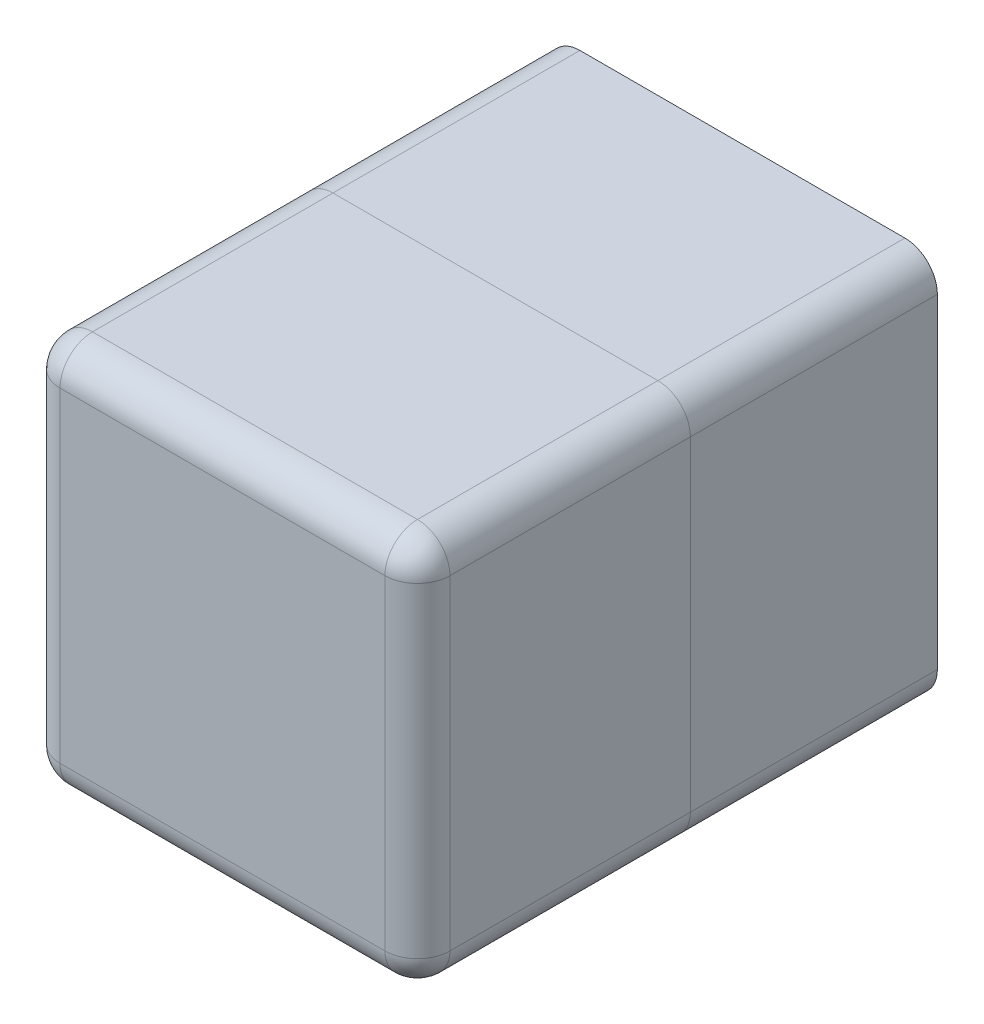
ISO-10303-21;
HEADER;
FILE_DESCRIPTION(('STEP AP214'),'2;1');
FILE_NAME('part.step','',(''),(''),'','','');
FILE_SCHEMA(('AUTOMOTIVE_DESIGN { 1 0 10303 214 1 1 1 1 }'));
ENDSEC;
DATA;
#1=APPLICATION_CONTEXT('core data for automotive mechanical design processes');
#2=APPLICATION_PROTOCOL_DEFINITION('international standard','automotive_design',2000,#1);
#3=PRODUCT_CONTEXT('',#1,'mechanical');
#4=PRODUCT('Part','Part','',(#3));
#5=PRODUCT_RELATED_PRODUCT_CATEGORY('part','',(#4));
#6=PRODUCT_DEFINITION_FORMATION('','',#4);
#7=PRODUCT_DEFINITION_CONTEXT('part definition',#1,'design');
#8=PRODUCT_DEFINITION('design','',#6,#7);
#9=PRODUCT_DEFINITION_SHAPE('','',#8);
#10=(LENGTH_UNIT() NAMED_UNIT(*) SI_UNIT(.MILLI.,.METRE.));
#11=(NAMED_UNIT(*) PLANE_ANGLE_UNIT() SI_UNIT($,.RADIAN.));
#12=(NAMED_UNIT(*) SI_UNIT($,.STERADIAN.) SOLID_ANGLE_UNIT());
#13=UNCERTAINTY_MEASURE_WITH_UNIT(LENGTH_MEASURE(1.E-05),#10,'distance_accuracy_value','');
#14=(GEOMETRIC_REPRESENTATION_CONTEXT(3) GLOBAL_UNCERTAINTY_ASSIGNED_CONTEXT((#13)) GLOBAL_UNIT_ASSIGNED_CONTEXT((#10,
#11,#12)) REPRESENTATION_CONTEXT('',''));
#15=CARTESIAN_POINT('',(0.,0.,0.));
#16=DIRECTION('',(0.,0.,1.));
#17=DIRECTION('',(1.,0.,0.));
#18=AXIS2_PLACEMENT_3D('',#15,#16,#17);
#19=CARTESIAN_POINT('',(60.,0.,-38.));
#20=DIRECTION('',(0.,1.,0.));
#21=DIRECTION('',(0.,0.,1.));
#22=AXIS2_PLACEMENT_3D('',#19,#20,#21);
#23=PLANE('',#22);
#24=DIRECTION('',(-1.,0.,0.));
#25=VECTOR('',#24,1.);
#26=CARTESIAN_POINT('',(60.,0.,0.));
#27=LINE('',#26,#25);
#28=CARTESIAN_POINT('',(55.,0.,0.));
#29=VERTEX_POINT('',#28);
#30=CARTESIAN_POINT('',(5.,0.,0.));
#31=VERTEX_POINT('',#30);
#32=EDGE_CURVE('E145',#29,#31,#27,.T.);
#33=ORIENTED_EDGE('',*,*,#32,.T.);
#34=DIRECTION('',(0.,0.,1.));
#35=VECTOR('',#34,1.);
#36=CARTESIAN_POINT('',(5.,0.,-38.));
#37=LINE('',#36,#35);
#38=CARTESIAN_POINT('',(5.,0.,-38.));
#39=VERTEX_POINT('',#38);
#40=EDGE_CURVE('E123',#31,#39,#37,.F.);
#41=ORIENTED_EDGE('',*,*,#40,.T.);
#42=DIRECTION('',(-1.,0.,0.));
#43=VECTOR('',#42,1.);
#44=CARTESIAN_POINT('',(60.,0.,-38.));
#45=LINE('',#44,#43);
#46=CARTESIAN_POINT('',(55.,0.,-38.));
#47=VERTEX_POINT('',#46);
#48=EDGE_CURVE('E155',#47,#39,#45,.T.);
#49=ORIENTED_EDGE('',*,*,#48,.F.);
#50=DIRECTION('',(0.,0.,1.));
#51=VECTOR('',#50,1.);
#52=CARTESIAN_POINT('',(55.,0.,-38.));
#53=LINE('',#52,#51);
#54=EDGE_CURVE('E128',#47,#29,#53,.T.);
#55=ORIENTED_EDGE('',*,*,#54,.T.);
#56=EDGE_LOOP('',(#33,#41,#49,#55));
#57=FACE_BOUND('',#56,.T.);
#58=ADVANCED_FACE('F52',(#57),#23,.F.);
#59=CARTESIAN_POINT('',(0.,0.,-38.));
#60=DIRECTION('',(1.,0.,0.));
#61=DIRECTION('',(0.,0.,-1.));
#62=AXIS2_PLACEMENT_3D('',#59,#60,#61);
#63=PLANE('',#62);
#64=DIRECTION('',(0.,1.,0.));
#65=VECTOR('',#64,1.);
#66=CARTESIAN_POINT('',(0.,0.,-38.));
#67=LINE('',#66,#65);
#68=CARTESIAN_POINT('',(0.,5.,-38.));
#69=VERTEX_POINT('',#68);
#70=CARTESIAN_POINT('',(0.,55.,-38.));
#71=VERTEX_POINT('',#70);
#72=EDGE_CURVE('E138',#69,#71,#67,.T.);
#73=ORIENTED_EDGE('',*,*,#72,.F.);
#74=DIRECTION('',(0.,0.,1.));
#75=VECTOR('',#74,1.);
#76=CARTESIAN_POINT('',(0.,5.,-38.));
#77=LINE('',#76,#75);
#78=CARTESIAN_POINT('',(0.,5.,0.));
#79=VERTEX_POINT('',#78);
#80=EDGE_CURVE('E122',#69,#79,#77,.T.);
#81=ORIENTED_EDGE('',*,*,#80,.T.);
#82=DIRECTION('',(0.,1.,0.));
#83=VECTOR('',#82,1.);
#84=CARTESIAN_POINT('',(0.,0.,0.));
#85=LINE('',#84,#83);
#86=CARTESIAN_POINT('',(0.,55.,0.));
#87=VERTEX_POINT('',#86);
#88=EDGE_CURVE('E135',#79,#87,#85,.T.);
#89=ORIENTED_EDGE('',*,*,#88,.T.);
#90=DIRECTION('',(0.,0.,1.));
#91=VECTOR('',#90,1.);
#92=CARTESIAN_POINT('',(0.,55.,-38.));
#93=LINE('',#92,#91);
#94=EDGE_CURVE('E140',#87,#71,#93,.F.);
#95=ORIENTED_EDGE('',*,*,#94,.T.);
#96=EDGE_LOOP('',(#73,#81,#89,#95));
#97=FACE_BOUND('',#96,.T.);
#98=ADVANCED_FACE('F134',(#97),#63,.F.);
#99=CARTESIAN_POINT('',(0.,60.,-38.));
#100=DIRECTION('',(0.,-1.,0.));
#101=DIRECTION('',(0.,0.,-1.));
#102=AXIS2_PLACEMENT_3D('',#99,#100,#101);
#103=PLANE('',#102);
#104=DIRECTION('',(1.,0.,0.));
#105=VECTOR('',#104,1.);
#106=CARTESIAN_POINT('',(0.,60.,0.));
#107=LINE('',#106,#105);
#108=CARTESIAN_POINT('',(5.,60.,0.));
#109=VERTEX_POINT('',#108);
#110=CARTESIAN_POINT('',(55.,60.,0.));
#111=VERTEX_POINT('',#110);
#112=EDGE_CURVE('E144',#109,#111,#107,.T.);
#113=ORIENTED_EDGE('',*,*,#112,.T.);
#114=DIRECTION('',(0.,0.,1.));
#115=VECTOR('',#114,1.);
#116=CARTESIAN_POINT('',(55.,60.,-38.));
#117=LINE('',#116,#115);
#118=CARTESIAN_POINT('',(55.,60.,-38.));
#119=VERTEX_POINT('',#118);
#120=EDGE_CURVE('E12',#111,#119,#117,.F.);
#121=ORIENTED_EDGE('',*,*,#120,.T.);
#122=DIRECTION('',(1.,0.,0.));
#123=VECTOR('',#122,1.);
#124=CARTESIAN_POINT('',(0.,60.,-38.));
#125=LINE('',#124,#123);
#126=CARTESIAN_POINT('',(5.,60.,-38.));
#127=VERTEX_POINT('',#126);
#128=EDGE_CURVE('E181',#127,#119,#125,.T.);
#129=ORIENTED_EDGE('',*,*,#128,.F.);
#130=DIRECTION('',(0.,0.,1.));
#131=VECTOR('',#130,1.);
#132=CARTESIAN_POINT('',(5.,60.,-38.));
#133=LINE('',#132,#131);
#134=EDGE_CURVE('E60',#127,#109,#133,.T.);
#135=ORIENTED_EDGE('',*,*,#134,.T.);
#136=EDGE_LOOP('',(#113,#121,#129,#135));
#137=FACE_BOUND('',#136,.T.);
#138=ADVANCED_FACE('F179',(#137),#103,.F.);
#139=CARTESIAN_POINT('',(60.,60.,-38.));
#140=DIRECTION('',(-1.,0.,0.));
#141=DIRECTION('',(0.,0.,1.));
#142=AXIS2_PLACEMENT_3D('',#139,#140,#141);
#143=PLANE('',#142);
#144=DIRECTION('',(0.,-1.,0.));
#145=VECTOR('',#144,1.);
#146=CARTESIAN_POINT('',(60.,60.,0.));
#147=LINE('',#146,#145);
#148=CARTESIAN_POINT('',(60.,55.,0.));
#149=VERTEX_POINT('',#148);
#150=CARTESIAN_POINT('',(60.,5.,0.));
#151=VERTEX_POINT('',#150);
#152=EDGE_CURVE('E148',#149,#151,#147,.T.);
#153=ORIENTED_EDGE('',*,*,#152,.T.);
#154=DIRECTION('',(0.,0.,1.));
#155=VECTOR('',#154,1.);
#156=CARTESIAN_POINT('',(60.,5.,-38.));
#157=LINE('',#156,#155);
#158=CARTESIAN_POINT('',(60.,5.,-38.));
#159=VERTEX_POINT('',#158);
#160=EDGE_CURVE('E67',#151,#159,#157,.F.);
#161=ORIENTED_EDGE('',*,*,#160,.T.);
#162=DIRECTION('',(0.,-1.,0.));
#163=VECTOR('',#162,1.);
#164=CARTESIAN_POINT('',(60.,60.,-38.));
#165=LINE('',#164,#163);
#166=CARTESIAN_POINT('',(60.,55.,-38.));
#167=VERTEX_POINT('',#166);
#168=EDGE_CURVE('E156',#167,#159,#165,.T.);
#169=ORIENTED_EDGE('',*,*,#168,.F.);
#170=DIRECTION('',(0.,0.,1.));
#171=VECTOR('',#170,1.);
#172=CARTESIAN_POINT('',(60.,55.,-38.));
#173=LINE('',#172,#171);
#174=EDGE_CURVE('E172',#167,#149,#173,.T.);
#175=ORIENTED_EDGE('',*,*,#174,.T.);
#176=EDGE_LOOP('',(#153,#161,#169,#175));
#177=FACE_BOUND('',#176,.T.);
#178=ADVANCED_FACE('F188',(#177),#143,.F.);
#179=CARTESIAN_POINT('',(0.,0.,-38.));
#180=DIRECTION('',(0.,0.,-1.));
#181=DIRECTION('',(-1.,0.,0.));
#182=AXIS2_PLACEMENT_3D('',#179,#180,#181);
#183=PLANE('',#182);
#184=CARTESIAN_POINT('',(30.,40.,-38.));
#185=DIRECTION('',(0.,0.,-1.));
#186=DIRECTION('',(-1.,0.,0.));
#187=AXIS2_PLACEMENT_3D('',#184,#185,#186);
#188=CIRCLE('',#187,12.);
#189=CARTESIAN_POINT('',(18.,40.,-38.));
#190=VERTEX_POINT('',#189);
#191=EDGE_CURVE('E219',#190,#190,#188,.T.);
#192=ORIENTED_EDGE('',*,*,#191,.F.);
#193=EDGE_LOOP('',(#192));
#194=FACE_BOUND('',#193,.T.);
#195=CARTESIAN_POINT('',(5.25126265847084,5.25126265847083,-38.));
#196=DIRECTION('',(0.,0.,-1.));
#197=DIRECTION('',(1.,0.,0.));
#198=AXIS2_PLACEMENT_3D('',#195,#196,#197);
#199=CIRCLE('',#198,2.25);
#200=CARTESIAN_POINT('',(7.50126265847084,5.25126265847083,-38.));
#201=VERTEX_POINT('',#200);
#202=EDGE_CURVE('E201',#201,#201,#199,.T.);
#203=ORIENTED_EDGE('',*,*,#202,.F.);
#204=EDGE_LOOP('',(#203));
#205=FACE_BOUND('',#204,.T.);
#206=CARTESIAN_POINT('',(54.7487373415292,5.25126265847084,-38.));
#207=DIRECTION('',(0.,0.,-1.));
#208=DIRECTION('',(-1.,0.,0.));
#209=AXIS2_PLACEMENT_3D('',#206,#207,#208);
#210=CIRCLE('',#209,2.25);
#211=CARTESIAN_POINT('',(52.4987373415292,5.25126265847084,-38.));
#212=VERTEX_POINT('',#211);
#213=EDGE_CURVE('E208',#212,#212,#210,.T.);
#214=ORIENTED_EDGE('',*,*,#213,.F.);
#215=EDGE_LOOP('',(#214));
#216=FACE_BOUND('',#215,.T.);
#217=CARTESIAN_POINT('',(54.7487373415292,54.7487373415292,-38.));
#218=DIRECTION('',(0.,0.,-1.));
#219=DIRECTION('',(1.,0.,0.));
#220=AXIS2_PLACEMENT_3D('',#217,#218,#219);
#221=CIRCLE('',#220,2.25);
#222=CARTESIAN_POINT('',(56.9987373415292,54.7487373415292,-38.));
#223=VERTEX_POINT('',#222);
#224=EDGE_CURVE('E214',#223,#223,#221,.T.);
#225=ORIENTED_EDGE('',*,*,#224,.F.);
#226=EDGE_LOOP('',(#225));
#227=FACE_BOUND('',#226,.T.);
#228=CARTESIAN_POINT('',(5.25126265847084,54.7487373415292,-38.));
#229=DIRECTION('',(0.,0.,-1.));
#230=DIRECTION('',(-1.,0.,0.));
#231=AXIS2_PLACEMENT_3D('',#228,#229,#230);
#232=CIRCLE('',#231,2.25);
#233=CARTESIAN_POINT('',(3.00126265847084,54.7487373415292,-38.));
#234=VERTEX_POINT('',#233);
#235=EDGE_CURVE('E195',#234,#234,#232,.T.);
#236=ORIENTED_EDGE('',*,*,#235,.F.);
#237=EDGE_LOOP('',(#236));
#238=FACE_BOUND('',#237,.T.);
#239=ORIENTED_EDGE('',*,*,#48,.T.);
#240=CARTESIAN_POINT('',(5.,5.,-38.));
#241=DIRECTION('',(0.,0.,-1.));
#242=DIRECTION('',(-1.,0.,0.));
#243=AXIS2_PLACEMENT_3D('',#240,#241,#242);
#244=CIRCLE('',#243,5.);
#245=EDGE_CURVE('E170',#39,#69,#244,.T.);
#246=ORIENTED_EDGE('',*,*,#245,.T.);
#247=ORIENTED_EDGE('',*,*,#72,.T.);
#248=CARTESIAN_POINT('',(5.,55.,-38.));
#249=DIRECTION('',(0.,0.,-1.));
#250=DIRECTION('',(-1.,0.,0.));
#251=AXIS2_PLACEMENT_3D('',#248,#249,#250);
#252=CIRCLE('',#251,5.);
#253=EDGE_CURVE('E165',#71,#127,#252,.T.);
#254=ORIENTED_EDGE('',*,*,#253,.T.);
#255=ORIENTED_EDGE('',*,*,#128,.T.);
#256=CARTESIAN_POINT('',(55.,55.,-38.));
#257=DIRECTION('',(0.,0.,-1.));
#258=DIRECTION('',(-1.,0.,0.));
#259=AXIS2_PLACEMENT_3D('',#256,#257,#258);
#260=CIRCLE('',#259,5.);
#261=EDGE_CURVE('E74',#119,#167,#260,.T.);
#262=ORIENTED_EDGE('',*,*,#261,.T.);
#263=ORIENTED_EDGE('',*,*,#168,.T.);
#264=CARTESIAN_POINT('',(55.,5.,-38.));
#265=DIRECTION('',(0.,0.,-1.));
#266=DIRECTION('',(-1.,0.,0.));
#267=AXIS2_PLACEMENT_3D('',#264,#265,#266);
#268=CIRCLE('',#267,5.);
#269=EDGE_CURVE('E168',#159,#47,#268,.T.);
#270=ORIENTED_EDGE('',*,*,#269,.T.);
#271=EDGE_LOOP('',(#239,#246,#247,#254,#255,#262,#263,#270));
#272=FACE_BOUND('',#271,.T.);
#273=ADVANCED_FACE('F271',(#194,#205,#216,#227,#238,#272),#183,.T.);
#274=CARTESIAN_POINT('',(0.,0.,0.));
#275=DIRECTION('',(0.,0.,-1.));
#276=DIRECTION('',(-1.,0.,0.));
#277=AXIS2_PLACEMENT_3D('',#274,#275,#276);
#278=PLANE('',#277);
#279=ORIENTED_EDGE('',*,*,#88,.F.);
#280=CARTESIAN_POINT('',(5.,5.,0.));
#281=DIRECTION('',(0.,0.,-1.));
#282=DIRECTION('',(-1.,0.,0.));
#283=AXIS2_PLACEMENT_3D('',#280,#281,#282);
#284=CIRCLE('',#283,5.);
#285=EDGE_CURVE('E118',#79,#31,#284,.F.);
#286=ORIENTED_EDGE('',*,*,#285,.T.);
#287=ORIENTED_EDGE('',*,*,#32,.F.);
#288=CARTESIAN_POINT('',(55.,5.,0.));
#289=DIRECTION('',(0.,0.,-1.));
#290=DIRECTION('',(-1.,0.,0.));
#291=AXIS2_PLACEMENT_3D('',#288,#289,#290);
#292=CIRCLE('',#291,5.);
#293=EDGE_CURVE('E129',#29,#151,#292,.F.);
#294=ORIENTED_EDGE('',*,*,#293,.T.);
#295=ORIENTED_EDGE('',*,*,#152,.F.);
#296=CARTESIAN_POINT('',(55.,55.,0.));
#297=DIRECTION('',(0.,0.,-1.));
#298=DIRECTION('',(-1.,0.,0.));
#299=AXIS2_PLACEMENT_3D('',#296,#297,#298);
#300=CIRCLE('',#299,5.);
#301=EDGE_CURVE('E159',#149,#111,#300,.F.);
#302=ORIENTED_EDGE('',*,*,#301,.T.);
#303=ORIENTED_EDGE('',*,*,#112,.F.);
#304=CARTESIAN_POINT('',(5.,55.,0.));
#305=DIRECTION('',(0.,0.,-1.));
#306=DIRECTION('',(-1.,0.,0.));
#307=AXIS2_PLACEMENT_3D('',#304,#305,#306);
#308=CIRCLE('',#307,5.);
#309=EDGE_CURVE('E139',#109,#87,#308,.F.);
#310=ORIENTED_EDGE('',*,*,#309,.T.);
#311=EDGE_LOOP('',(#279,#286,#287,#294,#295,#302,#303,#310));
#312=FACE_BOUND('',#311,.T.);
#313=ADVANCED_FACE('F142',(#312),#278,.F.);
#314=CARTESIAN_POINT('',(5.,5.,-38.));
#315=DIRECTION('',(0.,0.,1.));
#316=DIRECTION('',(1.,0.,0.));
#317=AXIS2_PLACEMENT_3D('',#314,#315,#316);
#318=CYLINDRICAL_SURFACE('',#317,5.);
#319=ORIENTED_EDGE('',*,*,#245,.F.);
#320=ORIENTED_EDGE('',*,*,#40,.F.);
#321=ORIENTED_EDGE('',*,*,#285,.F.);
#322=ORIENTED_EDGE('',*,*,#80,.F.);
#323=EDGE_LOOP('',(#319,#320,#321,#322));
#324=FACE_BOUND('',#323,.T.);
#325=ADVANCED_FACE('F121',(#324),#318,.T.);
#326=CARTESIAN_POINT('',(55.,5.,-38.));
#327=DIRECTION('',(0.,0.,1.));
#328=DIRECTION('',(1.,0.,0.));
#329=AXIS2_PLACEMENT_3D('',#326,#327,#328);
#330=CYLINDRICAL_SURFACE('',#329,5.);
#331=ORIENTED_EDGE('',*,*,#269,.F.);
#332=ORIENTED_EDGE('',*,*,#160,.F.);
#333=ORIENTED_EDGE('',*,*,#293,.F.);
#334=ORIENTED_EDGE('',*,*,#54,.F.);
#335=EDGE_LOOP('',(#331,#332,#333,#334));
#336=FACE_BOUND('',#335,.T.);
#337=ADVANCED_FACE('F257',(#336),#330,.T.);
#338=CARTESIAN_POINT('',(55.,55.,-38.));
#339=DIRECTION('',(0.,0.,1.));
#340=DIRECTION('',(1.,0.,0.));
#341=AXIS2_PLACEMENT_3D('',#338,#339,#340);
#342=CYLINDRICAL_SURFACE('',#341,5.);
#343=ORIENTED_EDGE('',*,*,#261,.F.);
#344=ORIENTED_EDGE('',*,*,#120,.F.);
#345=ORIENTED_EDGE('',*,*,#301,.F.);
#346=ORIENTED_EDGE('',*,*,#174,.F.);
#347=EDGE_LOOP('',(#343,#344,#345,#346));
#348=FACE_BOUND('',#347,.T.);
#349=ADVANCED_FACE('F187',(#348),#342,.T.);
#350=CARTESIAN_POINT('',(5.,55.,-38.));
#351=DIRECTION('',(0.,0.,1.));
#352=DIRECTION('',(1.,0.,0.));
#353=AXIS2_PLACEMENT_3D('',#350,#351,#352);
#354=CYLINDRICAL_SURFACE('',#353,5.);
#355=ORIENTED_EDGE('',*,*,#253,.F.);
#356=ORIENTED_EDGE('',*,*,#94,.F.);
#357=ORIENTED_EDGE('',*,*,#309,.F.);
#358=ORIENTED_EDGE('',*,*,#134,.F.);
#359=EDGE_LOOP('',(#355,#356,#357,#358));
#360=FACE_BOUND('',#359,.T.);
#361=ADVANCED_FACE('F54',(#360),#354,.T.);
#362=CARTESIAN_POINT('',(5.25126265847084,54.7487373415292,-28.));
#363=DIRECTION('',(0.,0.,-1.));
#364=DIRECTION('',(-1.,0.,0.));
#365=AXIS2_PLACEMENT_3D('',#362,#363,#364);
#366=CYLINDRICAL_SURFACE('',#365,2.25);
#367=CARTESIAN_POINT('',(5.25126265847084,54.7487373415292,-28.));
#368=DIRECTION('',(0.,0.,-1.));
#369=DIRECTION('',(-1.,0.,0.));
#370=AXIS2_PLACEMENT_3D('',#367,#368,#369);
#371=CIRCLE('',#370,2.25);
#372=CARTESIAN_POINT('',(3.00126265847084,54.7487373415292,-28.));
#373=VERTEX_POINT('',#372);
#374=EDGE_CURVE('E150',#373,#373,#371,.T.);
#375=ORIENTED_EDGE('',*,*,#374,.F.);
#376=EDGE_LOOP('',(#375));
#377=FACE_BOUND('',#376,.T.);
#378=ORIENTED_EDGE('',*,*,#235,.T.);
#379=EDGE_LOOP('',(#378));
#380=FACE_BOUND('',#379,.T.);
#381=ADVANCED_FACE('F264',(#377,#380),#366,.F.);
#382=CARTESIAN_POINT('',(5.25126265847084,54.7487373415292,-28.));
#383=DIRECTION('',(0.,0.,-1.));
#384=DIRECTION('',(-1.,0.,0.));
#385=AXIS2_PLACEMENT_3D('',#382,#383,#384);
#386=PLANE('',#385);
#387=ORIENTED_EDGE('',*,*,#374,.T.);
#388=EDGE_LOOP('',(#387));
#389=FACE_BOUND('',#388,.T.);
#390=ADVANCED_FACE('F268',(#389),#386,.T.);
#391=CARTESIAN_POINT('',(54.7487373415292,54.7487373415292,-28.));
#392=DIRECTION('',(0.,0.,-1.));
#393=DIRECTION('',(-1.,0.,0.));
#394=AXIS2_PLACEMENT_3D('',#391,#392,#393);
#395=CYLINDRICAL_SURFACE('',#394,2.25);
#396=CARTESIAN_POINT('',(54.7487373415292,54.7487373415292,-28.));
#397=DIRECTION('',(0.,0.,-1.));
#398=DIRECTION('',(1.,0.,0.));
#399=AXIS2_PLACEMENT_3D('',#396,#397,#398);
#400=CIRCLE('',#399,2.25);
#401=CARTESIAN_POINT('',(56.9987373415292,54.7487373415292,-28.));
#402=VERTEX_POINT('',#401);
#403=EDGE_CURVE('E198',#402,#402,#400,.T.);
#404=ORIENTED_EDGE('',*,*,#403,.F.);
#405=EDGE_LOOP('',(#404));
#406=FACE_BOUND('',#405,.T.);
#407=ORIENTED_EDGE('',*,*,#224,.T.);
#408=EDGE_LOOP('',(#407));
#409=FACE_BOUND('',#408,.T.);
#410=ADVANCED_FACE('F337',(#406,#409),#395,.F.);
#411=CARTESIAN_POINT('',(54.7487373415292,54.7487373415292,-28.));
#412=DIRECTION('',(0.,0.,1.));
#413=DIRECTION('',(1.,0.,0.));
#414=AXIS2_PLACEMENT_3D('',#411,#412,#413);
#415=PLANE('',#414);
#416=ORIENTED_EDGE('',*,*,#403,.T.);
#417=EDGE_LOOP('',(#416));
#418=FACE_BOUND('',#417,.T.);
#419=ADVANCED_FACE('F346',(#418),#415,.F.);
#420=CARTESIAN_POINT('',(54.7487373415292,5.25126265847084,-28.));
#421=DIRECTION('',(0.,0.,-1.));
#422=DIRECTION('',(-1.,0.,0.));
#423=AXIS2_PLACEMENT_3D('',#420,#421,#422);
#424=CYLINDRICAL_SURFACE('',#423,2.25);
#425=CARTESIAN_POINT('',(54.7487373415292,5.25126265847084,-28.));
#426=DIRECTION('',(0.,0.,-1.));
#427=DIRECTION('',(-1.,0.,0.));
#428=AXIS2_PLACEMENT_3D('',#425,#426,#427);
#429=CIRCLE('',#428,2.25);
#430=CARTESIAN_POINT('',(52.4987373415292,5.25126265847084,-28.));
#431=VERTEX_POINT('',#430);
#432=EDGE_CURVE('E211',#431,#431,#429,.T.);
#433=ORIENTED_EDGE('',*,*,#432,.F.);
#434=EDGE_LOOP('',(#433));
#435=FACE_BOUND('',#434,.T.);
#436=ORIENTED_EDGE('',*,*,#213,.T.);
#437=EDGE_LOOP('',(#436));
#438=FACE_BOUND('',#437,.T.);
#439=ADVANCED_FACE('F356',(#435,#438),#424,.F.);
#440=CARTESIAN_POINT('',(54.7487373415292,5.25126265847084,-28.));
#441=DIRECTION('',(0.,0.,-1.));
#442=DIRECTION('',(-1.,0.,0.));
#443=AXIS2_PLACEMENT_3D('',#440,#441,#442);
#444=PLANE('',#443);
#445=ORIENTED_EDGE('',*,*,#432,.T.);
#446=EDGE_LOOP('',(#445));
#447=FACE_BOUND('',#446,.T.);
#448=ADVANCED_FACE('F366',(#447),#444,.T.);
#449=CARTESIAN_POINT('',(5.25126265847084,5.25126265847083,-28.));
#450=DIRECTION('',(0.,0.,-1.));
#451=DIRECTION('',(-1.,0.,0.));
#452=AXIS2_PLACEMENT_3D('',#449,#450,#451);
#453=CYLINDRICAL_SURFACE('',#452,2.25);
#454=CARTESIAN_POINT('',(5.25126265847084,5.25126265847083,-28.));
#455=DIRECTION('',(0.,0.,-1.));
#456=DIRECTION('',(1.,0.,0.));
#457=AXIS2_PLACEMENT_3D('',#454,#455,#456);
#458=CIRCLE('',#457,2.25);
#459=CARTESIAN_POINT('',(7.50126265847084,5.25126265847083,-28.));
#460=VERTEX_POINT('',#459);
#461=EDGE_CURVE('E204',#460,#460,#458,.T.);
#462=ORIENTED_EDGE('',*,*,#461,.F.);
#463=EDGE_LOOP('',(#462));
#464=FACE_BOUND('',#463,.T.);
#465=ORIENTED_EDGE('',*,*,#202,.T.);
#466=EDGE_LOOP('',(#465));
#467=FACE_BOUND('',#466,.T.);
#468=ADVANCED_FACE('F376',(#464,#467),#453,.F.);
#469=CARTESIAN_POINT('',(5.25126265847084,5.25126265847083,-28.));
#470=DIRECTION('',(0.,0.,1.));
#471=DIRECTION('',(1.,0.,0.));
#472=AXIS2_PLACEMENT_3D('',#469,#470,#471);
#473=PLANE('',#472);
#474=ORIENTED_EDGE('',*,*,#461,.T.);
#475=EDGE_LOOP('',(#474));
#476=FACE_BOUND('',#475,.T.);
#477=ADVANCED_FACE('F386',(#476),#473,.F.);
#478=CARTESIAN_POINT('',(30.,40.,-42.));
#479=DIRECTION('',(0.,0.,1.));
#480=DIRECTION('',(1.,0.,0.));
#481=AXIS2_PLACEMENT_3D('',#478,#479,#480);
#482=CYLINDRICAL_SURFACE('',#481,12.);
#483=CARTESIAN_POINT('',(30.,40.,-42.));
#484=DIRECTION('',(0.,0.,-1.));
#485=DIRECTION('',(-1.,0.,0.));
#486=AXIS2_PLACEMENT_3D('',#483,#484,#485);
#487=CIRCLE('',#486,12.);
#488=CARTESIAN_POINT('',(18.,40.,-42.));
#489=VERTEX_POINT('',#488);
#490=EDGE_CURVE('E205',#489,#489,#487,.T.);
#491=ORIENTED_EDGE('',*,*,#490,.F.);
#492=EDGE_LOOP('',(#491));
#493=FACE_BOUND('',#492,.T.);
#494=ORIENTED_EDGE('',*,*,#191,.T.);
#495=EDGE_LOOP('',(#494));
#496=FACE_BOUND('',#495,.T.);
#497=ADVANCED_FACE('F243',(#493,#496),#482,.T.);
#498=CARTESIAN_POINT('',(30.,40.,-42.));
#499=DIRECTION('',(0.,0.,-1.));
#500=DIRECTION('',(-1.,0.,0.));
#501=AXIS2_PLACEMENT_3D('',#498,#499,#500);
#502=PLANE('',#501);
#503=CARTESIAN_POINT('',(30.,40.,-42.));
#504=DIRECTION('',(0.,0.,-1.));
#505=DIRECTION('',(-1.,0.,0.));
#506=AXIS2_PLACEMENT_3D('',#503,#504,#505);
#507=CIRCLE('',#506,5.);
#508=CARTESIAN_POINT('',(25.,40.,-42.));
#509=VERTEX_POINT('',#508);
#510=EDGE_CURVE('E222',#509,#509,#507,.T.);
#511=ORIENTED_EDGE('',*,*,#510,.F.);
#512=EDGE_LOOP('',(#511));
#513=FACE_BOUND('',#512,.T.);
#514=ORIENTED_EDGE('',*,*,#490,.T.);
#515=EDGE_LOOP('',(#514));
#516=FACE_BOUND('',#515,.T.);
#517=ADVANCED_FACE('F235',(#513,#516),#502,.T.);
#518=CARTESIAN_POINT('',(30.,40.,-37.));
#519=DIRECTION('',(0.,0.,-1.));
#520=DIRECTION('',(-1.,0.,0.));
#521=AXIS2_PLACEMENT_3D('',#518,#519,#520);
#522=CYLINDRICAL_SURFACE('',#521,5.);
#523=ORIENTED_EDGE('',*,*,#510,.T.);
#524=EDGE_LOOP('',(#523));
#525=FACE_BOUND('',#524,.T.);
#526=CARTESIAN_POINT('',(30.,40.,-37.));
#527=DIRECTION('',(0.,0.,-1.));
#528=DIRECTION('',(-1.,0.,0.));
#529=AXIS2_PLACEMENT_3D('',#526,#527,#528);
#530=CIRCLE('',#529,5.);
#531=CARTESIAN_POINT('',(25.,40.,-37.));
#532=VERTEX_POINT('',#531);
#533=EDGE_CURVE('E227',#532,#532,#530,.T.);
#534=ORIENTED_EDGE('',*,*,#533,.F.);
#535=EDGE_LOOP('',(#534));
#536=FACE_BOUND('',#535,.T.);
#537=ADVANCED_FACE('F233',(#525,#536),#522,.F.);
#538=CARTESIAN_POINT('',(30.,40.,-37.));
#539=DIRECTION('',(0.,0.,-1.));
#540=DIRECTION('',(-1.,0.,0.));
#541=AXIS2_PLACEMENT_3D('',#538,#539,#540);
#542=PLANE('',#541);
#543=ORIENTED_EDGE('',*,*,#533,.T.);
#544=EDGE_LOOP('',(#543));
#545=FACE_BOUND('',#544,.T.);
#546=ADVANCED_FACE('F231',(#545),#542,.T.);
#547=CLOSED_SHELL('',(#58,#98,#138,#178,#273,#313,#325,#337,#349,#361,#381,#390,#410,#419,#439,
#448,#468,#477,#497,#517,#537,#546));
#548=MANIFOLD_SOLID_BREP('B2',#547);
#549=CARTESIAN_POINT('',(0.,0.,42.));
#550=DIRECTION('',(1.,0.,0.));
#551=DIRECTION('',(0.,0.,-1.));
#552=AXIS2_PLACEMENT_3D('',#549,#550,#551);
#553=PLANE('',#552);
#554=DIRECTION('',(0.,0.,-1.));
#555=VECTOR('',#554,1.);
#556=CARTESIAN_POINT('',(0.,5.,42.));
#557=LINE('',#556,#555);
#558=CARTESIAN_POINT('',(0.,5.,0.));
#559=VERTEX_POINT('',#558);
#560=CARTESIAN_POINT('',(0.,5.,37.));
#561=VERTEX_POINT('',#560);
#562=EDGE_CURVE('E554',#559,#561,#557,.F.);
#563=ORIENTED_EDGE('',*,*,#562,.T.);
#564=DIRECTION('',(0.,-1.,0.));
#565=VECTOR('',#564,1.);
#566=CARTESIAN_POINT('',(0.,0.,37.));
#567=LINE('',#566,#565);
#568=CARTESIAN_POINT('',(0.,55.,37.));
#569=VERTEX_POINT('',#568);
#570=EDGE_CURVE('E601',#561,#569,#567,.F.);
#571=ORIENTED_EDGE('',*,*,#570,.T.);
#572=DIRECTION('',(0.,0.,-1.));
#573=VECTOR('',#572,1.);
#574=CARTESIAN_POINT('',(0.,55.,42.));
#575=LINE('',#574,#573);
#576=CARTESIAN_POINT('',(0.,55.,0.));
#577=VERTEX_POINT('',#576);
#578=EDGE_CURVE('E558',#569,#577,#575,.T.);
#579=ORIENTED_EDGE('',*,*,#578,.T.);
#580=DIRECTION('',(0.,-1.,0.));
#581=VECTOR('',#580,1.);
#582=CARTESIAN_POINT('',(0.,0.,0.));
#583=LINE('',#582,#581);
#584=EDGE_CURVE('E565',#577,#559,#583,.T.);
#585=ORIENTED_EDGE('',*,*,#584,.T.);
#586=EDGE_LOOP('',(#563,#571,#579,#585));
#587=FACE_BOUND('',#586,.T.);
#588=ADVANCED_FACE('F459',(#587),#553,.F.);
#589=CARTESIAN_POINT('',(0.,0.,42.));
#590=DIRECTION('',(0.,1.,0.));
#591=DIRECTION('',(0.,0.,1.));
#592=AXIS2_PLACEMENT_3D('',#589,#590,#591);
#593=PLANE('',#592);
#594=DIRECTION('',(0.,0.,-1.));
#595=VECTOR('',#594,1.);
#596=CARTESIAN_POINT('',(55.,0.,42.));
#597=LINE('',#596,#595);
#598=CARTESIAN_POINT('',(55.,0.,0.));
#599=VERTEX_POINT('',#598);
#600=CARTESIAN_POINT('',(55.,0.,37.));
#601=VERTEX_POINT('',#600);
#602=EDGE_CURVE('E548',#599,#601,#597,.F.);
#603=ORIENTED_EDGE('',*,*,#602,.T.);
#604=DIRECTION('',(1.,0.,0.));
#605=VECTOR('',#604,1.);
#606=CARTESIAN_POINT('',(0.,0.,37.));
#607=LINE('',#606,#605);
#608=CARTESIAN_POINT('',(5.,0.,37.));
#609=VERTEX_POINT('',#608);
#610=EDGE_CURVE('E50',#601,#609,#607,.F.);
#611=ORIENTED_EDGE('',*,*,#610,.T.);
#612=DIRECTION('',(0.,0.,-1.));
#613=VECTOR('',#612,1.);
#614=CARTESIAN_POINT('',(5.,0.,42.));
#615=LINE('',#614,#613);
#616=CARTESIAN_POINT('',(5.,0.,0.));
#617=VERTEX_POINT('',#616);
#618=EDGE_CURVE('E538',#609,#617,#615,.T.);
#619=ORIENTED_EDGE('',*,*,#618,.T.);
#620=DIRECTION('',(1.,0.,0.));
#621=VECTOR('',#620,1.);
#622=CARTESIAN_POINT('',(0.,0.,0.));
#623=LINE('',#622,#621);
#624=EDGE_CURVE('E542',#617,#599,#623,.T.);
#625=ORIENTED_EDGE('',*,*,#624,.T.);
#626=EDGE_LOOP('',(#603,#611,#619,#625));
#627=FACE_BOUND('',#626,.T.);
#628=ADVANCED_FACE('F540',(#627),#593,.F.);
#629=CARTESIAN_POINT('',(60.,0.,42.));
#630=DIRECTION('',(-1.,0.,0.));
#631=DIRECTION('',(0.,0.,1.));
#632=AXIS2_PLACEMENT_3D('',#629,#630,#631);
#633=PLANE('',#632);
#634=DIRECTION('',(0.,0.,-1.));
#635=VECTOR('',#634,1.);
#636=CARTESIAN_POINT('',(60.,55.,42.));
#637=LINE('',#636,#635);
#638=CARTESIAN_POINT('',(60.,55.,0.));
#639=VERTEX_POINT('',#638);
#640=CARTESIAN_POINT('',(60.,55.,37.));
#641=VERTEX_POINT('',#640);
#642=EDGE_CURVE('E581',#639,#641,#637,.F.);
#643=ORIENTED_EDGE('',*,*,#642,.T.);
#644=DIRECTION('',(0.,1.,0.));
#645=VECTOR('',#644,1.);
#646=CARTESIAN_POINT('',(60.,0.,37.));
#647=LINE('',#646,#645);
#648=CARTESIAN_POINT('',(60.,5.,37.));
#649=VERTEX_POINT('',#648);
#650=EDGE_CURVE('E483',#641,#649,#647,.F.);
#651=ORIENTED_EDGE('',*,*,#650,.T.);
#652=DIRECTION('',(0.,0.,-1.));
#653=VECTOR('',#652,1.);
#654=CARTESIAN_POINT('',(60.,5.,42.));
#655=LINE('',#654,#653);
#656=CARTESIAN_POINT('',(60.,5.,0.));
#657=VERTEX_POINT('',#656);
#658=EDGE_CURVE('E583',#649,#657,#655,.T.);
#659=ORIENTED_EDGE('',*,*,#658,.T.);
#660=DIRECTION('',(0.,1.,0.));
#661=VECTOR('',#660,1.);
#662=CARTESIAN_POINT('',(60.,0.,0.));
#663=LINE('',#662,#661);
#664=EDGE_CURVE('E564',#657,#639,#663,.T.);
#665=ORIENTED_EDGE('',*,*,#664,.T.);
#666=EDGE_LOOP('',(#643,#651,#659,#665));
#667=FACE_BOUND('',#666,.T.);
#668=ADVANCED_FACE('F645',(#667),#633,.F.);
#669=CARTESIAN_POINT('',(0.,60.,42.));
#670=DIRECTION('',(0.,-1.,0.));
#671=DIRECTION('',(0.,0.,-1.));
#672=AXIS2_PLACEMENT_3D('',#669,#670,#671);
#673=PLANE('',#672);
#674=DIRECTION('',(0.,0.,-1.));
#675=VECTOR('',#674,1.);
#676=CARTESIAN_POINT('',(5.,60.,42.));
#677=LINE('',#676,#675);
#678=CARTESIAN_POINT('',(5.,60.,0.));
#679=VERTEX_POINT('',#678);
#680=CARTESIAN_POINT('',(5.,60.,37.));
#681=VERTEX_POINT('',#680);
#682=EDGE_CURVE('E587',#679,#681,#677,.F.);
#683=ORIENTED_EDGE('',*,*,#682,.T.);
#684=DIRECTION('',(-1.,0.,0.));
#685=VECTOR('',#684,1.);
#686=CARTESIAN_POINT('',(0.,60.,37.));
#687=LINE('',#686,#685);
#688=CARTESIAN_POINT('',(55.,60.,37.));
#689=VERTEX_POINT('',#688);
#690=EDGE_CURVE('E605',#681,#689,#687,.F.);
#691=ORIENTED_EDGE('',*,*,#690,.T.);
#692=DIRECTION('',(0.,0.,-1.));
#693=VECTOR('',#692,1.);
#694=CARTESIAN_POINT('',(55.,60.,42.));
#695=LINE('',#694,#693);
#696=CARTESIAN_POINT('',(55.,60.,0.));
#697=VERTEX_POINT('',#696);
#698=EDGE_CURVE('E585',#689,#697,#695,.T.);
#699=ORIENTED_EDGE('',*,*,#698,.T.);
#700=DIRECTION('',(-1.,0.,0.));
#701=VECTOR('',#700,1.);
#702=CARTESIAN_POINT('',(0.,60.,0.));
#703=LINE('',#702,#701);
#704=EDGE_CURVE('E568',#697,#679,#703,.T.);
#705=ORIENTED_EDGE('',*,*,#704,.T.);
#706=EDGE_LOOP('',(#683,#691,#699,#705));
#707=FACE_BOUND('',#706,.T.);
#708=ADVANCED_FACE('F650',(#707),#673,.F.);
#709=CARTESIAN_POINT('',(0.,0.,42.));
#710=DIRECTION('',(0.,0.,-1.));
#711=DIRECTION('',(-1.,0.,0.));
#712=AXIS2_PLACEMENT_3D('',#709,#710,#711);
#713=PLANE('',#712);
#714=DIRECTION('',(-1.,0.,0.));
#715=VECTOR('',#714,1.);
#716=CARTESIAN_POINT('',(0.,55.,42.));
#717=LINE('',#716,#715);
#718=CARTESIAN_POINT('',(55.,55.,42.));
#719=VERTEX_POINT('',#718);
#720=CARTESIAN_POINT('',(5.,55.,42.));
#721=VERTEX_POINT('',#720);
#722=EDGE_CURVE('E596',#719,#721,#717,.T.);
#723=ORIENTED_EDGE('',*,*,#722,.T.);
#724=DIRECTION('',(0.,-1.,0.));
#725=VECTOR('',#724,1.);
#726=CARTESIAN_POINT('',(5.,0.,42.));
#727=LINE('',#726,#725);
#728=CARTESIAN_POINT('',(5.,5.,42.));
#729=VERTEX_POINT('',#728);
#730=EDGE_CURVE('E598',#721,#729,#727,.T.);
#731=ORIENTED_EDGE('',*,*,#730,.T.);
#732=DIRECTION('',(1.,0.,0.));
#733=VECTOR('',#732,1.);
#734=CARTESIAN_POINT('',(0.,5.,42.));
#735=LINE('',#734,#733);
#736=CARTESIAN_POINT('',(55.,5.,42.));
#737=VERTEX_POINT('',#736);
#738=EDGE_CURVE('E592',#729,#737,#735,.T.);
#739=ORIENTED_EDGE('',*,*,#738,.T.);
#740=DIRECTION('',(0.,1.,0.));
#741=VECTOR('',#740,1.);
#742=CARTESIAN_POINT('',(55.,0.,42.));
#743=LINE('',#742,#741);
#744=EDGE_CURVE('E594',#737,#719,#743,.T.);
#745=ORIENTED_EDGE('',*,*,#744,.T.);
#746=EDGE_LOOP('',(#723,#731,#739,#745));
#747=FACE_BOUND('',#746,.T.);
#748=ADVANCED_FACE('F665',(#747),#713,.F.);
#749=CARTESIAN_POINT('',(0.,0.,0.));
#750=DIRECTION('',(0.,0.,-1.));
#751=DIRECTION('',(-1.,0.,0.));
#752=AXIS2_PLACEMENT_3D('',#749,#750,#751);
#753=PLANE('',#752);
#754=ORIENTED_EDGE('',*,*,#624,.F.);
#755=CARTESIAN_POINT('',(5.,5.,0.));
#756=DIRECTION('',(0.,0.,-1.));
#757=DIRECTION('',(-1.,0.,0.));
#758=AXIS2_PLACEMENT_3D('',#755,#756,#757);
#759=CIRCLE('',#758,5.);
#760=EDGE_CURVE('E551',#617,#559,#759,.T.);
#761=ORIENTED_EDGE('',*,*,#760,.T.);
#762=ORIENTED_EDGE('',*,*,#584,.F.);
#763=CARTESIAN_POINT('',(5.,55.,0.));
#764=DIRECTION('',(0.,0.,-1.));
#765=DIRECTION('',(-1.,0.,0.));
#766=AXIS2_PLACEMENT_3D('',#763,#764,#765);
#767=CIRCLE('',#766,5.);
#768=EDGE_CURVE('E576',#577,#679,#767,.T.);
#769=ORIENTED_EDGE('',*,*,#768,.T.);
#770=ORIENTED_EDGE('',*,*,#704,.F.);
#771=CARTESIAN_POINT('',(55.,55.,0.));
#772=DIRECTION('',(0.,0.,-1.));
#773=DIRECTION('',(-1.,0.,0.));
#774=AXIS2_PLACEMENT_3D('',#771,#772,#773);
#775=CIRCLE('',#774,5.);
#776=EDGE_CURVE('E547',#697,#639,#775,.T.);
#777=ORIENTED_EDGE('',*,*,#776,.T.);
#778=ORIENTED_EDGE('',*,*,#664,.F.);
#779=CARTESIAN_POINT('',(55.,5.,0.));
#780=DIRECTION('',(0.,0.,-1.));
#781=DIRECTION('',(-1.,0.,0.));
#782=AXIS2_PLACEMENT_3D('',#779,#780,#781);
#783=CIRCLE('',#782,5.);
#784=EDGE_CURVE('E559',#657,#599,#783,.T.);
#785=ORIENTED_EDGE('',*,*,#784,.T.);
#786=EDGE_LOOP('',(#754,#761,#762,#769,#770,#777,#778,#785));
#787=FACE_BOUND('',#786,.T.);
#788=ADVANCED_FACE('F561',(#787),#753,.T.);
#789=CARTESIAN_POINT('',(5.,5.,42.));
#790=DIRECTION('',(0.,0.,-1.));
#791=DIRECTION('',(-1.,0.,0.));
#792=AXIS2_PLACEMENT_3D('',#789,#790,#791);
#793=CYLINDRICAL_SURFACE('',#792,5.);
#794=ORIENTED_EDGE('',*,*,#618,.F.);
#795=CARTESIAN_POINT('',(5.,5.,37.));
#796=DIRECTION('',(0.,0.,-1.));
#797=DIRECTION('',(-1.,0.,0.));
#798=AXIS2_PLACEMENT_3D('',#795,#796,#797);
#799=CIRCLE('',#798,5.);
#800=EDGE_CURVE('E590',#609,#561,#799,.T.);
#801=ORIENTED_EDGE('',*,*,#800,.T.);
#802=ORIENTED_EDGE('',*,*,#562,.F.);
#803=ORIENTED_EDGE('',*,*,#760,.F.);
#804=EDGE_LOOP('',(#794,#801,#802,#803));
#805=FACE_BOUND('',#804,.T.);
#806=ADVANCED_FACE('F552',(#805),#793,.T.);
#807=CARTESIAN_POINT('',(55.,5.,42.));
#808=DIRECTION('',(0.,0.,-1.));
#809=DIRECTION('',(-1.,0.,0.));
#810=AXIS2_PLACEMENT_3D('',#807,#808,#809);
#811=CYLINDRICAL_SURFACE('',#810,5.);
#812=ORIENTED_EDGE('',*,*,#658,.F.);
#813=CARTESIAN_POINT('',(55.,5.,37.));
#814=DIRECTION('',(0.,0.,-1.));
#815=DIRECTION('',(-1.,0.,0.));
#816=AXIS2_PLACEMENT_3D('',#813,#814,#815);
#817=CIRCLE('',#816,5.);
#818=EDGE_CURVE('E468',#649,#601,#817,.T.);
#819=ORIENTED_EDGE('',*,*,#818,.T.);
#820=ORIENTED_EDGE('',*,*,#602,.F.);
#821=ORIENTED_EDGE('',*,*,#784,.F.);
#822=EDGE_LOOP('',(#812,#819,#820,#821));
#823=FACE_BOUND('',#822,.T.);
#824=ADVANCED_FACE('F687',(#823),#811,.T.);
#825=CARTESIAN_POINT('',(5.,55.,42.));
#826=DIRECTION('',(0.,0.,-1.));
#827=DIRECTION('',(-1.,0.,0.));
#828=AXIS2_PLACEMENT_3D('',#825,#826,#827);
#829=CYLINDRICAL_SURFACE('',#828,5.);
#830=ORIENTED_EDGE('',*,*,#578,.F.);
#831=CARTESIAN_POINT('',(5.,55.,37.));
#832=DIRECTION('',(0.,0.,-1.));
#833=DIRECTION('',(-1.,0.,0.));
#834=AXIS2_PLACEMENT_3D('',#831,#832,#833);
#835=CIRCLE('',#834,5.);
#836=EDGE_CURVE('E603',#569,#681,#835,.T.);
#837=ORIENTED_EDGE('',*,*,#836,.T.);
#838=ORIENTED_EDGE('',*,*,#682,.F.);
#839=ORIENTED_EDGE('',*,*,#768,.F.);
#840=EDGE_LOOP('',(#830,#837,#838,#839));
#841=FACE_BOUND('',#840,.T.);
#842=ADVANCED_FACE('F653',(#841),#829,.T.);
#843=CARTESIAN_POINT('',(55.,55.,42.));
#844=DIRECTION('',(0.,0.,-1.));
#845=DIRECTION('',(-1.,0.,0.));
#846=AXIS2_PLACEMENT_3D('',#843,#844,#845);
#847=CYLINDRICAL_SURFACE('',#846,5.);
#848=ORIENTED_EDGE('',*,*,#698,.F.);
#849=CARTESIAN_POINT('',(55.,55.,37.));
#850=DIRECTION('',(0.,0.,-1.));
#851=DIRECTION('',(-1.,0.,0.));
#852=AXIS2_PLACEMENT_3D('',#849,#850,#851);
#853=CIRCLE('',#852,5.);
#854=EDGE_CURVE('E607',#689,#641,#853,.T.);
#855=ORIENTED_EDGE('',*,*,#854,.T.);
#856=ORIENTED_EDGE('',*,*,#642,.F.);
#857=ORIENTED_EDGE('',*,*,#776,.F.);
#858=EDGE_LOOP('',(#848,#855,#856,#857));
#859=FACE_BOUND('',#858,.T.);
#860=ADVANCED_FACE('F643',(#859),#847,.T.);
#861=CARTESIAN_POINT('',(55.,55.,37.));
#862=DIRECTION('',(0.,0.,-1.));
#863=DIRECTION('',(-1.,0.,0.));
#864=AXIS2_PLACEMENT_3D('',#861,#862,#863);
#865=SPHERICAL_SURFACE('',#864,5.);
#866=CARTESIAN_POINT('',(55.,55.,37.));
#867=DIRECTION('',(0.,-1.,0.));
#868=DIRECTION('',(0.,0.,-1.));
#869=AXIS2_PLACEMENT_3D('',#866,#867,#868);
#870=CIRCLE('',#869,5.);
#871=EDGE_CURVE('E626',#641,#719,#870,.T.);
#872=ORIENTED_EDGE('',*,*,#871,.F.);
#873=ORIENTED_EDGE('',*,*,#854,.F.);
#874=CARTESIAN_POINT('',(55.,55.,37.));
#875=DIRECTION('',(-1.,0.,0.));
#876=DIRECTION('',(0.,0.,1.));
#877=AXIS2_PLACEMENT_3D('',#874,#875,#876);
#878=CIRCLE('',#877,5.);
#879=EDGE_CURVE('E463',#719,#689,#878,.T.);
#880=ORIENTED_EDGE('',*,*,#879,.F.);
#881=EDGE_LOOP('',(#872,#873,#880));
#882=FACE_BOUND('',#881,.T.);
#883=ADVANCED_FACE('F461',(#882),#865,.T.);
#884=CARTESIAN_POINT('',(0.,55.,37.));
#885=DIRECTION('',(-1.,0.,0.));
#886=DIRECTION('',(0.,0.,1.));
#887=AXIS2_PLACEMENT_3D('',#884,#885,#886);
#888=CYLINDRICAL_SURFACE('',#887,5.);
#889=ORIENTED_EDGE('',*,*,#879,.T.);
#890=ORIENTED_EDGE('',*,*,#690,.F.);
#891=CARTESIAN_POINT('',(5.,55.,37.));
#892=DIRECTION('',(-1.,0.,0.));
#893=DIRECTION('',(0.,0.,1.));
#894=AXIS2_PLACEMENT_3D('',#891,#892,#893);
#895=CIRCLE('',#894,5.);
#896=EDGE_CURVE('E624',#721,#681,#895,.T.);
#897=ORIENTED_EDGE('',*,*,#896,.F.);
#898=ORIENTED_EDGE('',*,*,#722,.F.);
#899=EDGE_LOOP('',(#889,#890,#897,#898));
#900=FACE_BOUND('',#899,.T.);
#901=ADVANCED_FACE('F636',(#900),#888,.T.);
#902=CARTESIAN_POINT('',(55.,0.,37.));
#903=DIRECTION('',(0.,1.,0.));
#904=DIRECTION('',(0.,0.,1.));
#905=AXIS2_PLACEMENT_3D('',#902,#903,#904);
#906=CYLINDRICAL_SURFACE('',#905,5.);
#907=ORIENTED_EDGE('',*,*,#871,.T.);
#908=ORIENTED_EDGE('',*,*,#744,.F.);
#909=CARTESIAN_POINT('',(55.,5.,37.));
#910=DIRECTION('',(0.,-1.,0.));
#911=DIRECTION('',(0.,0.,-1.));
#912=AXIS2_PLACEMENT_3D('',#909,#910,#911);
#913=CIRCLE('',#912,5.);
#914=EDGE_CURVE('E621',#649,#737,#913,.T.);
#915=ORIENTED_EDGE('',*,*,#914,.F.);
#916=ORIENTED_EDGE('',*,*,#650,.F.);
#917=EDGE_LOOP('',(#907,#908,#915,#916));
#918=FACE_BOUND('',#917,.T.);
#919=ADVANCED_FACE('F667',(#918),#906,.T.);
#920=CARTESIAN_POINT('',(5.,55.,37.));
#921=DIRECTION('',(0.,0.,-1.));
#922=DIRECTION('',(-1.,0.,0.));
#923=AXIS2_PLACEMENT_3D('',#920,#921,#922);
#924=SPHERICAL_SURFACE('',#923,5.);
#925=ORIENTED_EDGE('',*,*,#896,.T.);
#926=ORIENTED_EDGE('',*,*,#836,.F.);
#927=CARTESIAN_POINT('',(5.,55.,37.));
#928=DIRECTION('',(0.,-1.,0.));
#929=DIRECTION('',(0.,0.,-1.));
#930=AXIS2_PLACEMENT_3D('',#927,#928,#929);
#931=CIRCLE('',#930,5.);
#932=EDGE_CURVE('E618',#721,#569,#931,.T.);
#933=ORIENTED_EDGE('',*,*,#932,.F.);
#934=EDGE_LOOP('',(#925,#926,#933));
#935=FACE_BOUND('',#934,.T.);
#936=ADVANCED_FACE('F657',(#935),#924,.T.);
#937=CARTESIAN_POINT('',(55.,5.,37.));
#938=DIRECTION('',(0.,0.,-1.));
#939=DIRECTION('',(-1.,0.,0.));
#940=AXIS2_PLACEMENT_3D('',#937,#938,#939);
#941=SPHERICAL_SURFACE('',#940,5.);
#942=ORIENTED_EDGE('',*,*,#818,.F.);
#943=ORIENTED_EDGE('',*,*,#914,.T.);
#944=CARTESIAN_POINT('',(55.,5.,37.));
#945=DIRECTION('',(-1.,0.,0.));
#946=DIRECTION('',(0.,0.,1.));
#947=AXIS2_PLACEMENT_3D('',#944,#945,#946);
#948=CIRCLE('',#947,5.);
#949=EDGE_CURVE('E615',#601,#737,#948,.T.);
#950=ORIENTED_EDGE('',*,*,#949,.F.);
#951=EDGE_LOOP('',(#942,#943,#950));
#952=FACE_BOUND('',#951,.T.);
#953=ADVANCED_FACE('F670',(#952),#941,.T.);
#954=CARTESIAN_POINT('',(5.,0.,37.));
#955=DIRECTION('',(0.,-1.,0.));
#956=DIRECTION('',(0.,0.,-1.));
#957=AXIS2_PLACEMENT_3D('',#954,#955,#956);
#958=CYLINDRICAL_SURFACE('',#957,5.);
#959=ORIENTED_EDGE('',*,*,#932,.T.);
#960=ORIENTED_EDGE('',*,*,#570,.F.);
#961=CARTESIAN_POINT('',(5.,5.,37.));
#962=DIRECTION('',(0.,-1.,0.));
#963=DIRECTION('',(0.,0.,-1.));
#964=AXIS2_PLACEMENT_3D('',#961,#962,#963);
#965=CIRCLE('',#964,5.);
#966=EDGE_CURVE('E613',#729,#561,#965,.T.);
#967=ORIENTED_EDGE('',*,*,#966,.F.);
#968=ORIENTED_EDGE('',*,*,#730,.F.);
#969=EDGE_LOOP('',(#959,#960,#967,#968));
#970=FACE_BOUND('',#969,.T.);
#971=ADVANCED_FACE('F661',(#970),#958,.T.);
#972=CARTESIAN_POINT('',(0.,5.,37.));
#973=DIRECTION('',(1.,0.,0.));
#974=DIRECTION('',(0.,0.,-1.));
#975=AXIS2_PLACEMENT_3D('',#972,#973,#974);
#976=CYLINDRICAL_SURFACE('',#975,5.);
#977=ORIENTED_EDGE('',*,*,#949,.T.);
#978=ORIENTED_EDGE('',*,*,#738,.F.);
#979=CARTESIAN_POINT('',(5.,5.,37.));
#980=DIRECTION('',(-1.,0.,0.));
#981=DIRECTION('',(0.,0.,1.));
#982=AXIS2_PLACEMENT_3D('',#979,#980,#981);
#983=CIRCLE('',#982,5.);
#984=EDGE_CURVE('E611',#609,#729,#983,.T.);
#985=ORIENTED_EDGE('',*,*,#984,.F.);
#986=ORIENTED_EDGE('',*,*,#610,.F.);
#987=EDGE_LOOP('',(#977,#978,#985,#986));
#988=FACE_BOUND('',#987,.T.);
#989=ADVANCED_FACE('F672',(#988),#976,.T.);
#990=CARTESIAN_POINT('',(5.,5.,37.));
#991=DIRECTION('',(0.,0.,-1.));
#992=DIRECTION('',(-1.,0.,0.));
#993=AXIS2_PLACEMENT_3D('',#990,#991,#992);
#994=SPHERICAL_SURFACE('',#993,5.);
#995=ORIENTED_EDGE('',*,*,#966,.T.);
#996=ORIENTED_EDGE('',*,*,#800,.F.);
#997=ORIENTED_EDGE('',*,*,#984,.T.);
#998=EDGE_LOOP('',(#995,#996,#997));
#999=FACE_BOUND('',#998,.T.);
#1000=ADVANCED_FACE('F675',(#999),#994,.T.);
#1001=CLOSED_SHELL('',(#588,#628,#668,#708,#748,#788,#806,#824,#842,#860,#883,#901,#919,#936,
#953,#971,#989,#1000));
#1002=MANIFOLD_SOLID_BREP('B6',#1001);
#1003=ADVANCED_BREP_SHAPE_REPRESENTATION('',(#18,#548,#1002),#14);
#1004=SHAPE_DEFINITION_REPRESENTATION(#9,#1003);
ENDSEC;
END-ISO-10303-21;
